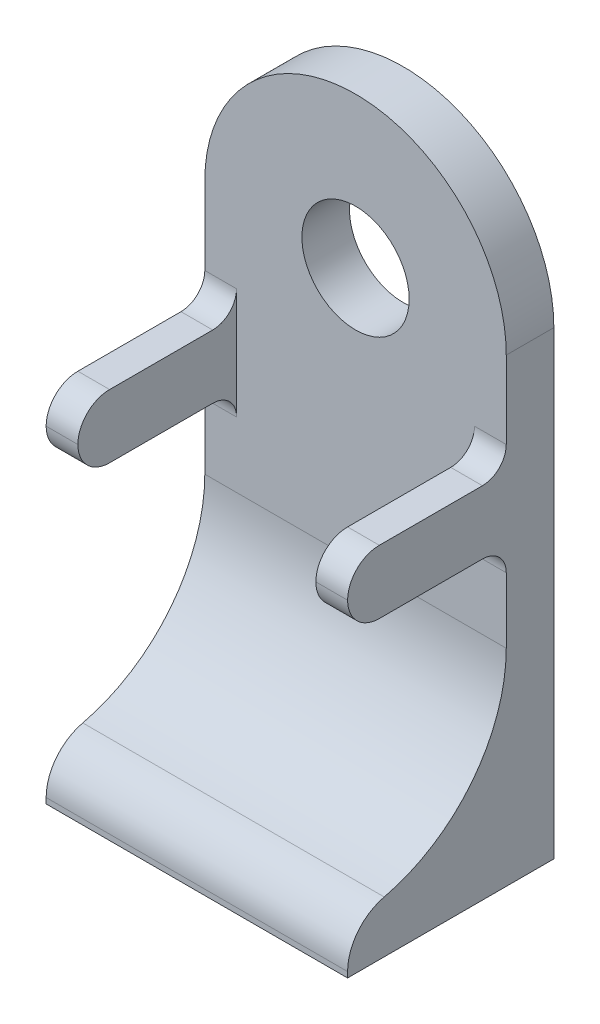
ISO-10303-21;
HEADER;
FILE_DESCRIPTION(('STEP AP214'),'2;1');
FILE_NAME('part.step','',(''),(''),'','','');
FILE_SCHEMA(('AUTOMOTIVE_DESIGN { 1 0 10303 214 1 1 1 1 }'));
ENDSEC;
DATA;
#1=APPLICATION_CONTEXT('core data for automotive mechanical design processes');
#2=APPLICATION_PROTOCOL_DEFINITION('international standard','automotive_design',2000,#1);
#3=PRODUCT_CONTEXT('',#1,'mechanical');
#4=PRODUCT('Part','Part','',(#3));
#5=PRODUCT_RELATED_PRODUCT_CATEGORY('part','',(#4));
#6=PRODUCT_DEFINITION_FORMATION('','',#4);
#7=PRODUCT_DEFINITION_CONTEXT('part definition',#1,'design');
#8=PRODUCT_DEFINITION('design','',#6,#7);
#9=PRODUCT_DEFINITION_SHAPE('','',#8);
#10=(LENGTH_UNIT() NAMED_UNIT(*) SI_UNIT(.MILLI.,.METRE.));
#11=(NAMED_UNIT(*) PLANE_ANGLE_UNIT() SI_UNIT($,.RADIAN.));
#12=(NAMED_UNIT(*) SI_UNIT($,.STERADIAN.) SOLID_ANGLE_UNIT());
#13=UNCERTAINTY_MEASURE_WITH_UNIT(LENGTH_MEASURE(1.E-05),#10,'distance_accuracy_value','');
#14=(GEOMETRIC_REPRESENTATION_CONTEXT(3) GLOBAL_UNCERTAINTY_ASSIGNED_CONTEXT((#13)) GLOBAL_UNIT_ASSIGNED_CONTEXT((#10,
#11,#12)) REPRESENTATION_CONTEXT('',''));
#15=CARTESIAN_POINT('',(0.,0.,0.));
#16=DIRECTION('',(0.,0.,1.));
#17=DIRECTION('',(1.,0.,0.));
#18=AXIS2_PLACEMENT_3D('',#15,#16,#17);
#19=CARTESIAN_POINT('',(0.,0.,3.));
#20=DIRECTION('',(0.,0.,-1.));
#21=DIRECTION('',(-1.,0.,0.));
#22=AXIS2_PLACEMENT_3D('',#19,#20,#21);
#23=PLANE('',#22);
#24=CARTESIAN_POINT('',(0.,0.,3.));
#25=DIRECTION('',(0.,0.,1.));
#26=DIRECTION('',(1.,0.,0.));
#27=AXIS2_PLACEMENT_3D('',#24,#25,#26);
#28=CIRCLE('',#27,3.38);
#29=CARTESIAN_POINT('',(3.38,0.,3.));
#30=VERTEX_POINT('',#29);
#31=EDGE_CURVE('E209',#30,#30,#28,.T.);
#32=ORIENTED_EDGE('',*,*,#31,.F.);
#33=EDGE_LOOP('',(#32));
#34=FACE_BOUND('',#33,.T.);
#35=DIRECTION('',(0.,-1.,0.));
#36=VECTOR('',#35,1.);
#37=CARTESIAN_POINT('',(-9.5,0.,3.));
#38=LINE('',#37,#36);
#39=CARTESIAN_POINT('',(-9.5,0.,3.));
#40=VERTEX_POINT('',#39);
#41=CARTESIAN_POINT('',(-9.5,-4.88,3.));
#42=VERTEX_POINT('',#41);
#43=EDGE_CURVE('E220',#40,#42,#38,.T.);
#44=ORIENTED_EDGE('',*,*,#43,.T.);
#45=DIRECTION('',(-1.,0.,0.));
#46=VECTOR('',#45,1.);
#47=CARTESIAN_POINT('',(-7.5,-4.88,3.));
#48=LINE('',#47,#46);
#49=CARTESIAN_POINT('',(-7.5,-4.88,3.));
#50=VERTEX_POINT('',#49);
#51=EDGE_CURVE('E255',#42,#50,#48,.F.);
#52=ORIENTED_EDGE('',*,*,#51,.T.);
#53=DIRECTION('',(0.,1.,0.));
#54=VECTOR('',#53,1.);
#55=CARTESIAN_POINT('',(-7.5,-6.38,3.));
#56=LINE('',#55,#54);
#57=CARTESIAN_POINT('',(-7.5,-11.88,3.));
#58=VERTEX_POINT('',#57);
#59=EDGE_CURVE('E347',#58,#50,#56,.T.);
#60=ORIENTED_EDGE('',*,*,#59,.F.);
#61=DIRECTION('',(1.,0.,0.));
#62=VECTOR('',#61,1.);
#63=CARTESIAN_POINT('',(-9.5,-11.88,3.));
#64=LINE('',#63,#62);
#65=CARTESIAN_POINT('',(-9.5,-11.88,3.));
#66=VERTEX_POINT('',#65);
#67=EDGE_CURVE('E248',#58,#66,#64,.F.);
#68=ORIENTED_EDGE('',*,*,#67,.T.);
#69=CARTESIAN_POINT('',(-9.5,-16.,3.));
#70=VERTEX_POINT('',#69);
#71=EDGE_CURVE('E218',#66,#70,#38,.T.);
#72=ORIENTED_EDGE('',*,*,#71,.T.);
#73=DIRECTION('',(1.,0.,0.));
#74=VECTOR('',#73,1.);
#75=CARTESIAN_POINT('',(0.,-16.,3.));
#76=LINE('',#75,#74);
#77=CARTESIAN_POINT('',(9.5,-16.,3.));
#78=VERTEX_POINT('',#77);
#79=EDGE_CURVE('E238',#70,#78,#76,.T.);
#80=ORIENTED_EDGE('',*,*,#79,.T.);
#81=DIRECTION('',(0.,1.,0.));
#82=VECTOR('',#81,1.);
#83=CARTESIAN_POINT('',(9.5,-29.,3.));
#84=LINE('',#83,#82);
#85=CARTESIAN_POINT('',(9.5,-11.88,3.));
#86=VERTEX_POINT('',#85);
#87=EDGE_CURVE('E224',#78,#86,#84,.T.);
#88=ORIENTED_EDGE('',*,*,#87,.T.);
#89=DIRECTION('',(1.,0.,0.));
#90=VECTOR('',#89,1.);
#91=CARTESIAN_POINT('',(7.5,-11.88,3.));
#92=LINE('',#91,#90);
#93=CARTESIAN_POINT('',(7.5,-11.88,3.));
#94=VERTEX_POINT('',#93);
#95=EDGE_CURVE('E250',#86,#94,#92,.F.);
#96=ORIENTED_EDGE('',*,*,#95,.T.);
#97=DIRECTION('',(0.,-1.,0.));
#98=VECTOR('',#97,1.);
#99=CARTESIAN_POINT('',(7.5,-6.38,3.));
#100=LINE('',#99,#98);
#101=CARTESIAN_POINT('',(7.5,-4.88,3.));
#102=VERTEX_POINT('',#101);
#103=EDGE_CURVE('E318',#102,#94,#100,.T.);
#104=ORIENTED_EDGE('',*,*,#103,.F.);
#105=DIRECTION('',(-1.,0.,0.));
#106=VECTOR('',#105,1.);
#107=CARTESIAN_POINT('',(9.5,-4.88,3.));
#108=LINE('',#107,#106);
#109=CARTESIAN_POINT('',(9.5,-4.88000000000001,3.));
#110=VERTEX_POINT('',#109);
#111=EDGE_CURVE('E253',#102,#110,#108,.F.);
#112=ORIENTED_EDGE('',*,*,#111,.T.);
#113=CARTESIAN_POINT('',(9.5,0.,3.));
#114=VERTEX_POINT('',#113);
#115=EDGE_CURVE('E223',#110,#114,#84,.T.);
#116=ORIENTED_EDGE('',*,*,#115,.T.);
#117=CARTESIAN_POINT('',(0.,0.,3.));
#118=DIRECTION('',(0.,0.,1.));
#119=DIRECTION('',(-1.,0.,0.));
#120=AXIS2_PLACEMENT_3D('',#117,#118,#119);
#121=CIRCLE('',#120,9.5);
#122=EDGE_CURVE('E215',#114,#40,#121,.T.);
#123=ORIENTED_EDGE('',*,*,#122,.T.);
#124=EDGE_LOOP('',(#44,#52,#60,#68,#72,#80,#88,#96,#104,#112,#116,#123));
#125=FACE_BOUND('',#124,.T.);
#126=ADVANCED_FACE('F38',(#34,#125),#23,.F.);
#127=CARTESIAN_POINT('',(0.,-16.,13.));
#128=DIRECTION('',(-1.,0.,0.));
#129=DIRECTION('',(0.,0.,1.));
#130=AXIS2_PLACEMENT_3D('',#127,#128,#129);
#131=CYLINDRICAL_SURFACE('',#130,10.);
#132=CARTESIAN_POINT('',(-9.5,-16.,13.));
#133=DIRECTION('',(1.,0.,0.));
#134=DIRECTION('',(0.,1.,0.));
#135=AXIS2_PLACEMENT_3D('',#132,#133,#134);
#136=CIRCLE('',#135,10.);
#137=CARTESIAN_POINT('',(-9.5,-25.7300851082104,10.6923076923077));
#138=VERTEX_POINT('',#137);
#139=EDGE_CURVE('E241',#70,#138,#136,.F.);
#140=ORIENTED_EDGE('',*,*,#139,.T.);
#141=DIRECTION('',(-1.,0.,0.));
#142=VECTOR('',#141,1.);
#143=CARTESIAN_POINT('',(0.,-25.7300851082104,10.6923076923077));
#144=LINE('',#143,#142);
#145=CARTESIAN_POINT('',(9.5,-25.7300851082104,10.6923076923077));
#146=VERTEX_POINT('',#145);
#147=EDGE_CURVE('E46',#138,#146,#144,.F.);
#148=ORIENTED_EDGE('',*,*,#147,.T.);
#149=CARTESIAN_POINT('',(9.5,-16.,13.));
#150=DIRECTION('',(-1.,0.,0.));
#151=DIRECTION('',(0.,-1.,0.));
#152=AXIS2_PLACEMENT_3D('',#149,#150,#151);
#153=CIRCLE('',#152,10.);
#154=EDGE_CURVE('E243',#146,#78,#153,.F.);
#155=ORIENTED_EDGE('',*,*,#154,.T.);
#156=ORIENTED_EDGE('',*,*,#79,.F.);
#157=EDGE_LOOP('',(#140,#148,#155,#156));
#158=FACE_BOUND('',#157,.T.);
#159=ADVANCED_FACE('F427',(#158),#131,.F.);
#160=CARTESIAN_POINT('',(0.,0.,0.));
#161=DIRECTION('',(0.,0.,-1.));
#162=DIRECTION('',(-1.,0.,0.));
#163=AXIS2_PLACEMENT_3D('',#160,#161,#162);
#164=PLANE('',#163);
#165=CARTESIAN_POINT('',(0.,0.,0.));
#166=DIRECTION('',(0.,0.,1.));
#167=DIRECTION('',(-1.,0.,0.));
#168=AXIS2_PLACEMENT_3D('',#165,#166,#167);
#169=CIRCLE('',#168,9.5);
#170=CARTESIAN_POINT('',(9.5,0.,0.));
#171=VERTEX_POINT('',#170);
#172=CARTESIAN_POINT('',(-9.5,0.,0.));
#173=VERTEX_POINT('',#172);
#174=EDGE_CURVE('E212',#171,#173,#169,.T.);
#175=ORIENTED_EDGE('',*,*,#174,.F.);
#176=DIRECTION('',(0.,1.,0.));
#177=VECTOR('',#176,1.);
#178=CARTESIAN_POINT('',(9.5,-29.,0.));
#179=LINE('',#178,#177);
#180=CARTESIAN_POINT('',(9.5,-29.,0.));
#181=VERTEX_POINT('',#180);
#182=EDGE_CURVE('E219',#181,#171,#179,.T.);
#183=ORIENTED_EDGE('',*,*,#182,.F.);
#184=DIRECTION('',(1.,0.,0.));
#185=VECTOR('',#184,1.);
#186=CARTESIAN_POINT('',(-9.5,-29.,0.));
#187=LINE('',#186,#185);
#188=CARTESIAN_POINT('',(-9.5,-29.,0.));
#189=VERTEX_POINT('',#188);
#190=EDGE_CURVE('E231',#189,#181,#187,.T.);
#191=ORIENTED_EDGE('',*,*,#190,.F.);
#192=DIRECTION('',(0.,-1.,0.));
#193=VECTOR('',#192,1.);
#194=CARTESIAN_POINT('',(-9.5,0.,0.));
#195=LINE('',#194,#193);
#196=EDGE_CURVE('E195',#173,#189,#195,.T.);
#197=ORIENTED_EDGE('',*,*,#196,.F.);
#198=EDGE_LOOP('',(#175,#183,#191,#197));
#199=FACE_BOUND('',#198,.T.);
#200=CARTESIAN_POINT('',(0.,0.,0.));
#201=DIRECTION('',(0.,0.,1.));
#202=DIRECTION('',(1.,0.,0.));
#203=AXIS2_PLACEMENT_3D('',#200,#201,#202);
#204=CIRCLE('',#203,3.38);
#205=CARTESIAN_POINT('',(3.38,0.,0.));
#206=VERTEX_POINT('',#205);
#207=EDGE_CURVE('E205',#206,#206,#204,.T.);
#208=ORIENTED_EDGE('',*,*,#207,.T.);
#209=EDGE_LOOP('',(#208));
#210=FACE_BOUND('',#209,.T.);
#211=ADVANCED_FACE('F433',(#199,#210),#164,.T.);
#212=CARTESIAN_POINT('',(0.,0.,3.));
#213=DIRECTION('',(0.,0.,-1.));
#214=DIRECTION('',(-1.,0.,0.));
#215=AXIS2_PLACEMENT_3D('',#212,#213,#214);
#216=CYLINDRICAL_SURFACE('',#215,9.5);
#217=ORIENTED_EDGE('',*,*,#174,.T.);
#218=DIRECTION('',(0.,0.,-1.));
#219=VECTOR('',#218,1.);
#220=CARTESIAN_POINT('',(-9.5,0.,3.));
#221=LINE('',#220,#219);
#222=EDGE_CURVE('E198',#40,#173,#221,.T.);
#223=ORIENTED_EDGE('',*,*,#222,.F.);
#224=ORIENTED_EDGE('',*,*,#122,.F.);
#225=DIRECTION('',(0.,0.,-1.));
#226=VECTOR('',#225,1.);
#227=CARTESIAN_POINT('',(9.5,0.,3.));
#228=LINE('',#227,#226);
#229=EDGE_CURVE('E227',#114,#171,#228,.T.);
#230=ORIENTED_EDGE('',*,*,#229,.T.);
#231=EDGE_LOOP('',(#217,#223,#224,#230));
#232=FACE_BOUND('',#231,.T.);
#233=ADVANCED_FACE('F400',(#232),#216,.T.);
#234=CARTESIAN_POINT('',(-9.5,0.,3.));
#235=DIRECTION('',(1.,0.,0.));
#236=DIRECTION('',(0.,1.,0.));
#237=AXIS2_PLACEMENT_3D('',#234,#235,#236);
#238=PLANE('',#237);
#239=DIRECTION('',(0.,-1.,0.));
#240=VECTOR('',#239,1.);
#241=CARTESIAN_POINT('',(-9.5,-29.,13.));
#242=LINE('',#241,#240);
#243=CARTESIAN_POINT('',(-9.5,-28.6491106406735,13.));
#244=VERTEX_POINT('',#243);
#245=CARTESIAN_POINT('',(-9.5,-29.,13.));
#246=VERTEX_POINT('',#245);
#247=EDGE_CURVE('E180',#244,#246,#242,.T.);
#248=ORIENTED_EDGE('',*,*,#247,.F.);
#249=CARTESIAN_POINT('',(-9.5,-28.6491106406735,10.));
#250=DIRECTION('',(1.,0.,0.));
#251=DIRECTION('',(0.,1.,0.));
#252=AXIS2_PLACEMENT_3D('',#249,#250,#251);
#253=CIRCLE('',#252,3.);
#254=EDGE_CURVE('E60',#244,#138,#253,.F.);
#255=ORIENTED_EDGE('',*,*,#254,.T.);
#256=ORIENTED_EDGE('',*,*,#139,.F.);
#257=ORIENTED_EDGE('',*,*,#71,.F.);
#258=CARTESIAN_POINT('',(-9.5,-11.88,4.5));
#259=DIRECTION('',(1.,0.,0.));
#260=DIRECTION('',(0.,1.,0.));
#261=AXIS2_PLACEMENT_3D('',#258,#259,#260);
#262=CIRCLE('',#261,1.5);
#263=CARTESIAN_POINT('',(-9.5,-10.38,4.5));
#264=VERTEX_POINT('',#263);
#265=EDGE_CURVE('E286',#66,#264,#262,.T.);
#266=ORIENTED_EDGE('',*,*,#265,.T.);
#267=DIRECTION('',(0.,0.,-1.));
#268=VECTOR('',#267,1.);
#269=CARTESIAN_POINT('',(-9.5,-10.38,13.));
#270=LINE('',#269,#268);
#271=CARTESIAN_POINT('',(-9.5,-10.38,11.));
#272=VERTEX_POINT('',#271);
#273=EDGE_CURVE('E340',#272,#264,#270,.T.);
#274=ORIENTED_EDGE('',*,*,#273,.F.);
#275=CARTESIAN_POINT('',(-9.5,-8.38,11.));
#276=DIRECTION('',(1.,0.,0.));
#277=DIRECTION('',(0.,1.,0.));
#278=AXIS2_PLACEMENT_3D('',#275,#276,#277);
#279=CIRCLE('',#278,2.);
#280=CARTESIAN_POINT('',(-9.5,-8.38,13.));
#281=VERTEX_POINT('',#280);
#282=EDGE_CURVE('E311',#272,#281,#279,.F.);
#283=ORIENTED_EDGE('',*,*,#282,.T.);
#284=CARTESIAN_POINT('',(-9.5,-8.38,11.));
#285=DIRECTION('',(1.,0.,0.));
#286=DIRECTION('',(0.,1.,0.));
#287=AXIS2_PLACEMENT_3D('',#284,#285,#286);
#288=CIRCLE('',#287,2.);
#289=CARTESIAN_POINT('',(-9.5,-6.38,11.));
#290=VERTEX_POINT('',#289);
#291=EDGE_CURVE('E309',#281,#290,#288,.F.);
#292=ORIENTED_EDGE('',*,*,#291,.T.);
#293=DIRECTION('',(0.,0.,-1.));
#294=VECTOR('',#293,1.);
#295=CARTESIAN_POINT('',(-9.5,-6.38,13.));
#296=LINE('',#295,#294);
#297=CARTESIAN_POINT('',(-9.5,-6.38,4.5));
#298=VERTEX_POINT('',#297);
#299=EDGE_CURVE('E189',#290,#298,#296,.T.);
#300=ORIENTED_EDGE('',*,*,#299,.T.);
#301=CARTESIAN_POINT('',(-9.5,-4.88,4.5));
#302=DIRECTION('',(1.,0.,0.));
#303=DIRECTION('',(0.,1.,0.));
#304=AXIS2_PLACEMENT_3D('',#301,#302,#303);
#305=CIRCLE('',#304,1.5);
#306=EDGE_CURVE('E267',#298,#42,#305,.T.);
#307=ORIENTED_EDGE('',*,*,#306,.T.);
#308=ORIENTED_EDGE('',*,*,#43,.F.);
#309=ORIENTED_EDGE('',*,*,#222,.T.);
#310=ORIENTED_EDGE('',*,*,#196,.T.);
#311=DIRECTION('',(0.,0.,-1.));
#312=VECTOR('',#311,1.);
#313=CARTESIAN_POINT('',(-9.5,-29.,3.));
#314=LINE('',#313,#312);
#315=EDGE_CURVE('E192',#246,#189,#314,.T.);
#316=ORIENTED_EDGE('',*,*,#315,.F.);
#317=EDGE_LOOP('',(#248,#255,#256,#257,#266,#274,#283,#292,#300,#307,#308,#309,#310,#316));
#318=FACE_BOUND('',#317,.T.);
#319=ADVANCED_FACE('F193',(#318),#238,.F.);
#320=CARTESIAN_POINT('',(-9.5,-29.,3.));
#321=DIRECTION('',(0.,1.,0.));
#322=DIRECTION('',(0.,0.,1.));
#323=AXIS2_PLACEMENT_3D('',#320,#321,#322);
#324=PLANE('',#323);
#325=ORIENTED_EDGE('',*,*,#190,.T.);
#326=DIRECTION('',(0.,0.,-1.));
#327=VECTOR('',#326,1.);
#328=CARTESIAN_POINT('',(9.5,-29.,3.));
#329=LINE('',#328,#327);
#330=CARTESIAN_POINT('',(9.5,-29.,13.));
#331=VERTEX_POINT('',#330);
#332=EDGE_CURVE('E199',#331,#181,#329,.T.);
#333=ORIENTED_EDGE('',*,*,#332,.F.);
#334=DIRECTION('',(1.,0.,0.));
#335=VECTOR('',#334,1.);
#336=CARTESIAN_POINT('',(-9.5,-29.,13.));
#337=LINE('',#336,#335);
#338=EDGE_CURVE('E185',#246,#331,#337,.T.);
#339=ORIENTED_EDGE('',*,*,#338,.F.);
#340=ORIENTED_EDGE('',*,*,#315,.T.);
#341=EDGE_LOOP('',(#325,#333,#339,#340));
#342=FACE_BOUND('',#341,.T.);
#343=ADVANCED_FACE('F201',(#342),#324,.F.);
#344=CARTESIAN_POINT('',(9.5,-29.,3.));
#345=DIRECTION('',(-1.,0.,0.));
#346=DIRECTION('',(0.,-1.,0.));
#347=AXIS2_PLACEMENT_3D('',#344,#345,#346);
#348=PLANE('',#347);
#349=ORIENTED_EDGE('',*,*,#154,.F.);
#350=CARTESIAN_POINT('',(9.5,-28.6491106406735,10.));
#351=DIRECTION('',(-1.,0.,0.));
#352=DIRECTION('',(0.,-1.,0.));
#353=AXIS2_PLACEMENT_3D('',#350,#351,#352);
#354=CIRCLE('',#353,3.);
#355=CARTESIAN_POINT('',(9.5,-28.6491106406735,13.));
#356=VERTEX_POINT('',#355);
#357=EDGE_CURVE('E11',#146,#356,#354,.F.);
#358=ORIENTED_EDGE('',*,*,#357,.T.);
#359=DIRECTION('',(0.,1.,0.));
#360=VECTOR('',#359,1.);
#361=CARTESIAN_POINT('',(9.5,-29.,13.));
#362=LINE('',#361,#360);
#363=EDGE_CURVE('E203',#331,#356,#362,.T.);
#364=ORIENTED_EDGE('',*,*,#363,.F.);
#365=ORIENTED_EDGE('',*,*,#332,.T.);
#366=ORIENTED_EDGE('',*,*,#182,.T.);
#367=ORIENTED_EDGE('',*,*,#229,.F.);
#368=ORIENTED_EDGE('',*,*,#115,.F.);
#369=CARTESIAN_POINT('',(9.5,-4.88,4.5));
#370=DIRECTION('',(-1.,0.,0.));
#371=DIRECTION('',(0.,-1.,0.));
#372=AXIS2_PLACEMENT_3D('',#369,#370,#371);
#373=CIRCLE('',#372,1.5);
#374=CARTESIAN_POINT('',(9.5,-6.38,4.5));
#375=VERTEX_POINT('',#374);
#376=EDGE_CURVE('E275',#110,#375,#373,.T.);
#377=ORIENTED_EDGE('',*,*,#376,.T.);
#378=DIRECTION('',(0.,0.,-1.));
#379=VECTOR('',#378,1.);
#380=CARTESIAN_POINT('',(9.5,-6.38,13.));
#381=LINE('',#380,#379);
#382=CARTESIAN_POINT('',(9.5,-6.38,11.));
#383=VERTEX_POINT('',#382);
#384=EDGE_CURVE('E349',#383,#375,#381,.T.);
#385=ORIENTED_EDGE('',*,*,#384,.F.);
#386=CARTESIAN_POINT('',(9.5,-8.38,11.));
#387=DIRECTION('',(-1.,0.,0.));
#388=DIRECTION('',(0.,-1.,0.));
#389=AXIS2_PLACEMENT_3D('',#386,#387,#388);
#390=CIRCLE('',#389,2.);
#391=CARTESIAN_POINT('',(9.5,-8.38,13.));
#392=VERTEX_POINT('',#391);
#393=EDGE_CURVE('E289',#383,#392,#390,.F.);
#394=ORIENTED_EDGE('',*,*,#393,.T.);
#395=CARTESIAN_POINT('',(9.5,-8.38,11.));
#396=DIRECTION('',(-1.,0.,0.));
#397=DIRECTION('',(0.,-1.,0.));
#398=AXIS2_PLACEMENT_3D('',#395,#396,#397);
#399=CIRCLE('',#398,2.);
#400=CARTESIAN_POINT('',(9.5,-10.38,11.));
#401=VERTEX_POINT('',#400);
#402=EDGE_CURVE('E291',#392,#401,#399,.F.);
#403=ORIENTED_EDGE('',*,*,#402,.T.);
#404=DIRECTION('',(0.,0.,-1.));
#405=VECTOR('',#404,1.);
#406=CARTESIAN_POINT('',(9.5,-10.38,13.));
#407=LINE('',#406,#405);
#408=CARTESIAN_POINT('',(9.5,-10.38,4.5));
#409=VERTEX_POINT('',#408);
#410=EDGE_CURVE('E355',#401,#409,#407,.T.);
#411=ORIENTED_EDGE('',*,*,#410,.T.);
#412=CARTESIAN_POINT('',(9.5,-11.88,4.5));
#413=DIRECTION('',(-1.,0.,0.));
#414=DIRECTION('',(0.,-1.,0.));
#415=AXIS2_PLACEMENT_3D('',#412,#413,#414);
#416=CIRCLE('',#415,1.5);
#417=EDGE_CURVE('E278',#409,#86,#416,.T.);
#418=ORIENTED_EDGE('',*,*,#417,.T.);
#419=ORIENTED_EDGE('',*,*,#87,.F.);
#420=EDGE_LOOP('',(#349,#358,#364,#365,#366,#367,#368,#377,#385,#394,#403,#411,#418,#419));
#421=FACE_BOUND('',#420,.T.);
#422=ADVANCED_FACE('F385',(#421),#348,.F.);
#423=CARTESIAN_POINT('',(0.,0.,3.));
#424=DIRECTION('',(0.,0.,-1.));
#425=DIRECTION('',(-1.,0.,0.));
#426=AXIS2_PLACEMENT_3D('',#423,#424,#425);
#427=CYLINDRICAL_SURFACE('',#426,3.38);
#428=ORIENTED_EDGE('',*,*,#31,.T.);
#429=EDGE_LOOP('',(#428));
#430=FACE_BOUND('',#429,.T.);
#431=ORIENTED_EDGE('',*,*,#207,.F.);
#432=EDGE_LOOP('',(#431));
#433=FACE_BOUND('',#432,.T.);
#434=ADVANCED_FACE('F438',(#430,#433),#427,.F.);
#435=CARTESIAN_POINT('',(0.,0.,13.));
#436=DIRECTION('',(0.,0.,-1.));
#437=DIRECTION('',(-1.,0.,0.));
#438=AXIS2_PLACEMENT_3D('',#435,#436,#437);
#439=PLANE('',#438);
#440=ORIENTED_EDGE('',*,*,#363,.T.);
#441=DIRECTION('',(-1.,0.,0.));
#442=VECTOR('',#441,1.);
#443=CARTESIAN_POINT('',(0.,-28.6491106406735,13.));
#444=LINE('',#443,#442);
#445=EDGE_CURVE('E188',#356,#244,#444,.T.);
#446=ORIENTED_EDGE('',*,*,#445,.T.);
#447=ORIENTED_EDGE('',*,*,#247,.T.);
#448=ORIENTED_EDGE('',*,*,#338,.T.);
#449=EDGE_LOOP('',(#440,#446,#447,#448));
#450=FACE_BOUND('',#449,.T.);
#451=ADVANCED_FACE('F183',(#450),#439,.F.);
#452=CARTESIAN_POINT('',(-7.5,-6.38,13.));
#453=DIRECTION('',(0.,-1.,0.));
#454=DIRECTION('',(0.,0.,-1.));
#455=AXIS2_PLACEMENT_3D('',#452,#453,#454);
#456=PLANE('',#455);
#457=ORIENTED_EDGE('',*,*,#299,.F.);
#458=DIRECTION('',(-1.,0.,0.));
#459=VECTOR('',#458,1.);
#460=CARTESIAN_POINT('',(-7.5,-6.38,11.));
#461=LINE('',#460,#459);
#462=CARTESIAN_POINT('',(-7.5,-6.38,11.));
#463=VERTEX_POINT('',#462);
#464=EDGE_CURVE('E313',#290,#463,#461,.F.);
#465=ORIENTED_EDGE('',*,*,#464,.T.);
#466=DIRECTION('',(0.,0.,-1.));
#467=VECTOR('',#466,1.);
#468=CARTESIAN_POINT('',(-7.5,-6.38,13.));
#469=LINE('',#468,#467);
#470=CARTESIAN_POINT('',(-7.5,-6.38,4.5));
#471=VERTEX_POINT('',#470);
#472=EDGE_CURVE('E345',#463,#471,#469,.T.);
#473=ORIENTED_EDGE('',*,*,#472,.T.);
#474=DIRECTION('',(-1.,0.,0.));
#475=VECTOR('',#474,1.);
#476=CARTESIAN_POINT('',(-9.5,-6.38,4.5));
#477=LINE('',#476,#475);
#478=EDGE_CURVE('E245',#471,#298,#477,.T.);
#479=ORIENTED_EDGE('',*,*,#478,.T.);
#480=EDGE_LOOP('',(#457,#465,#473,#479));
#481=FACE_BOUND('',#480,.T.);
#482=ADVANCED_FACE('F337',(#481),#456,.F.);
#483=CARTESIAN_POINT('',(-7.5,-10.38,13.));
#484=DIRECTION('',(0.,1.,0.));
#485=DIRECTION('',(0.,0.,1.));
#486=AXIS2_PLACEMENT_3D('',#483,#484,#485);
#487=PLANE('',#486);
#488=DIRECTION('',(0.,0.,-1.));
#489=VECTOR('',#488,1.);
#490=CARTESIAN_POINT('',(-7.5,-10.38,13.));
#491=LINE('',#490,#489);
#492=CARTESIAN_POINT('',(-7.5,-10.38,11.));
#493=VERTEX_POINT('',#492);
#494=CARTESIAN_POINT('',(-7.5,-10.38,4.5));
#495=VERTEX_POINT('',#494);
#496=EDGE_CURVE('E341',#493,#495,#491,.T.);
#497=ORIENTED_EDGE('',*,*,#496,.F.);
#498=DIRECTION('',(1.,0.,0.));
#499=VECTOR('',#498,1.);
#500=CARTESIAN_POINT('',(-7.5,-10.38,11.));
#501=LINE('',#500,#499);
#502=EDGE_CURVE('E306',#493,#272,#501,.F.);
#503=ORIENTED_EDGE('',*,*,#502,.T.);
#504=ORIENTED_EDGE('',*,*,#273,.T.);
#505=DIRECTION('',(1.,0.,0.));
#506=VECTOR('',#505,1.);
#507=CARTESIAN_POINT('',(-7.5,-10.38,4.5));
#508=LINE('',#507,#506);
#509=EDGE_CURVE('E264',#264,#495,#508,.T.);
#510=ORIENTED_EDGE('',*,*,#509,.T.);
#511=EDGE_LOOP('',(#497,#503,#504,#510));
#512=FACE_BOUND('',#511,.T.);
#513=ADVANCED_FACE('F417',(#512),#487,.F.);
#514=CARTESIAN_POINT('',(-7.5,-6.38,13.));
#515=DIRECTION('',(-1.,0.,0.));
#516=DIRECTION('',(0.,0.,1.));
#517=AXIS2_PLACEMENT_3D('',#514,#515,#516);
#518=PLANE('',#517);
#519=CARTESIAN_POINT('',(-7.5,-8.38,11.));
#520=DIRECTION('',(-1.,0.,0.));
#521=DIRECTION('',(0.,0.,1.));
#522=AXIS2_PLACEMENT_3D('',#519,#520,#521);
#523=CIRCLE('',#522,2.);
#524=CARTESIAN_POINT('',(-7.5,-8.38,13.));
#525=VERTEX_POINT('',#524);
#526=EDGE_CURVE('E302',#463,#525,#523,.F.);
#527=ORIENTED_EDGE('',*,*,#526,.T.);
#528=CARTESIAN_POINT('',(-7.5,-8.38,11.));
#529=DIRECTION('',(-1.,0.,0.));
#530=DIRECTION('',(0.,0.,1.));
#531=AXIS2_PLACEMENT_3D('',#528,#529,#530);
#532=CIRCLE('',#531,2.);
#533=EDGE_CURVE('E304',#525,#493,#532,.F.);
#534=ORIENTED_EDGE('',*,*,#533,.T.);
#535=ORIENTED_EDGE('',*,*,#496,.T.);
#536=CARTESIAN_POINT('',(-7.5,-11.88,4.5));
#537=DIRECTION('',(-1.,0.,0.));
#538=DIRECTION('',(0.,0.,1.));
#539=AXIS2_PLACEMENT_3D('',#536,#537,#538);
#540=CIRCLE('',#539,1.5);
#541=EDGE_CURVE('E283',#495,#58,#540,.T.);
#542=ORIENTED_EDGE('',*,*,#541,.T.);
#543=ORIENTED_EDGE('',*,*,#59,.T.);
#544=CARTESIAN_POINT('',(-7.5,-4.88,4.5));
#545=DIRECTION('',(-1.,0.,0.));
#546=DIRECTION('',(0.,0.,1.));
#547=AXIS2_PLACEMENT_3D('',#544,#545,#546);
#548=CIRCLE('',#547,1.5);
#549=EDGE_CURVE('E269',#50,#471,#548,.T.);
#550=ORIENTED_EDGE('',*,*,#549,.T.);
#551=ORIENTED_EDGE('',*,*,#472,.F.);
#552=EDGE_LOOP('',(#527,#534,#535,#542,#543,#550,#551));
#553=FACE_BOUND('',#552,.T.);
#554=ADVANCED_FACE('F406',(#553),#518,.F.);
#555=CARTESIAN_POINT('',(7.5,-6.38,13.));
#556=DIRECTION('',(0.,-1.,0.));
#557=DIRECTION('',(0.,0.,-1.));
#558=AXIS2_PLACEMENT_3D('',#555,#556,#557);
#559=PLANE('',#558);
#560=DIRECTION('',(0.,0.,-1.));
#561=VECTOR('',#560,1.);
#562=CARTESIAN_POINT('',(7.5,-6.38,13.));
#563=LINE('',#562,#561);
#564=CARTESIAN_POINT('',(7.5,-6.38,11.));
#565=VERTEX_POINT('',#564);
#566=CARTESIAN_POINT('',(7.5,-6.38,4.5));
#567=VERTEX_POINT('',#566);
#568=EDGE_CURVE('E351',#565,#567,#563,.T.);
#569=ORIENTED_EDGE('',*,*,#568,.F.);
#570=DIRECTION('',(-1.,0.,0.));
#571=VECTOR('',#570,1.);
#572=CARTESIAN_POINT('',(7.5,-6.38,11.));
#573=LINE('',#572,#571);
#574=EDGE_CURVE('E300',#565,#383,#573,.F.);
#575=ORIENTED_EDGE('',*,*,#574,.T.);
#576=ORIENTED_EDGE('',*,*,#384,.T.);
#577=DIRECTION('',(-1.,0.,0.));
#578=VECTOR('',#577,1.);
#579=CARTESIAN_POINT('',(7.5,-6.38,4.5));
#580=LINE('',#579,#578);
#581=EDGE_CURVE('E258',#375,#567,#580,.T.);
#582=ORIENTED_EDGE('',*,*,#581,.T.);
#583=EDGE_LOOP('',(#569,#575,#576,#582));
#584=FACE_BOUND('',#583,.T.);
#585=ADVANCED_FACE('F391',(#584),#559,.F.);
#586=CARTESIAN_POINT('',(7.5,-6.38,13.));
#587=DIRECTION('',(1.,0.,0.));
#588=DIRECTION('',(0.,0.,-1.));
#589=AXIS2_PLACEMENT_3D('',#586,#587,#588);
#590=PLANE('',#589);
#591=DIRECTION('',(0.,0.,-1.));
#592=VECTOR('',#591,1.);
#593=CARTESIAN_POINT('',(7.5,-10.38,13.));
#594=LINE('',#593,#592);
#595=CARTESIAN_POINT('',(7.5,-10.38,11.));
#596=VERTEX_POINT('',#595);
#597=CARTESIAN_POINT('',(7.5,-10.38,4.5));
#598=VERTEX_POINT('',#597);
#599=EDGE_CURVE('E353',#596,#598,#594,.T.);
#600=ORIENTED_EDGE('',*,*,#599,.F.);
#601=CARTESIAN_POINT('',(7.5,-8.38,11.));
#602=DIRECTION('',(1.,0.,0.));
#603=DIRECTION('',(0.,0.,-1.));
#604=AXIS2_PLACEMENT_3D('',#601,#602,#603);
#605=CIRCLE('',#604,2.);
#606=CARTESIAN_POINT('',(7.5,-8.38,13.));
#607=VERTEX_POINT('',#606);
#608=EDGE_CURVE('E298',#596,#607,#605,.F.);
#609=ORIENTED_EDGE('',*,*,#608,.T.);
#610=CARTESIAN_POINT('',(7.5,-8.38,11.));
#611=DIRECTION('',(1.,0.,0.));
#612=DIRECTION('',(0.,0.,-1.));
#613=AXIS2_PLACEMENT_3D('',#610,#611,#612);
#614=CIRCLE('',#613,2.);
#615=EDGE_CURVE('E296',#607,#565,#614,.F.);
#616=ORIENTED_EDGE('',*,*,#615,.T.);
#617=ORIENTED_EDGE('',*,*,#568,.T.);
#618=CARTESIAN_POINT('',(7.5,-4.88,4.5));
#619=DIRECTION('',(1.,0.,0.));
#620=DIRECTION('',(0.,0.,-1.));
#621=AXIS2_PLACEMENT_3D('',#618,#619,#620);
#622=CIRCLE('',#621,1.5);
#623=EDGE_CURVE('E272',#567,#102,#622,.T.);
#624=ORIENTED_EDGE('',*,*,#623,.T.);
#625=ORIENTED_EDGE('',*,*,#103,.T.);
#626=CARTESIAN_POINT('',(7.5,-11.88,4.5));
#627=DIRECTION('',(1.,0.,0.));
#628=DIRECTION('',(0.,0.,-1.));
#629=AXIS2_PLACEMENT_3D('',#626,#627,#628);
#630=CIRCLE('',#629,1.5);
#631=EDGE_CURVE('E280',#94,#598,#630,.T.);
#632=ORIENTED_EDGE('',*,*,#631,.T.);
#633=EDGE_LOOP('',(#600,#609,#616,#617,#624,#625,#632));
#634=FACE_BOUND('',#633,.T.);
#635=ADVANCED_FACE('F359',(#634),#590,.F.);
#636=CARTESIAN_POINT('',(7.5,-10.38,13.));
#637=DIRECTION('',(0.,1.,0.));
#638=DIRECTION('',(0.,0.,1.));
#639=AXIS2_PLACEMENT_3D('',#636,#637,#638);
#640=PLANE('',#639);
#641=ORIENTED_EDGE('',*,*,#410,.F.);
#642=DIRECTION('',(1.,0.,0.));
#643=VECTOR('',#642,1.);
#644=CARTESIAN_POINT('',(7.5,-10.38,11.));
#645=LINE('',#644,#643);
#646=EDGE_CURVE('E293',#401,#596,#645,.F.);
#647=ORIENTED_EDGE('',*,*,#646,.T.);
#648=ORIENTED_EDGE('',*,*,#599,.T.);
#649=DIRECTION('',(1.,0.,0.));
#650=VECTOR('',#649,1.);
#651=CARTESIAN_POINT('',(9.5,-10.38,4.5));
#652=LINE('',#651,#650);
#653=EDGE_CURVE('E261',#598,#409,#652,.T.);
#654=ORIENTED_EDGE('',*,*,#653,.T.);
#655=EDGE_LOOP('',(#641,#647,#648,#654));
#656=FACE_BOUND('',#655,.T.);
#657=ADVANCED_FACE('F372',(#656),#640,.F.);
#658=CARTESIAN_POINT('',(-7.5,-4.88,4.5));
#659=DIRECTION('',(1.,0.,0.));
#660=DIRECTION('',(0.,0.,-1.));
#661=AXIS2_PLACEMENT_3D('',#658,#659,#660);
#662=CYLINDRICAL_SURFACE('',#661,1.5);
#663=ORIENTED_EDGE('',*,*,#549,.F.);
#664=ORIENTED_EDGE('',*,*,#51,.F.);
#665=ORIENTED_EDGE('',*,*,#306,.F.);
#666=ORIENTED_EDGE('',*,*,#478,.F.);
#667=EDGE_LOOP('',(#663,#664,#665,#666));
#668=FACE_BOUND('',#667,.T.);
#669=ADVANCED_FACE('F404',(#668),#662,.F.);
#670=CARTESIAN_POINT('',(7.5,-4.88,4.5));
#671=DIRECTION('',(1.,0.,0.));
#672=DIRECTION('',(0.,0.,-1.));
#673=AXIS2_PLACEMENT_3D('',#670,#671,#672);
#674=CYLINDRICAL_SURFACE('',#673,1.5);
#675=ORIENTED_EDGE('',*,*,#376,.F.);
#676=ORIENTED_EDGE('',*,*,#111,.F.);
#677=ORIENTED_EDGE('',*,*,#623,.F.);
#678=ORIENTED_EDGE('',*,*,#581,.F.);
#679=EDGE_LOOP('',(#675,#676,#677,#678));
#680=FACE_BOUND('',#679,.T.);
#681=ADVANCED_FACE('F393',(#680),#674,.F.);
#682=CARTESIAN_POINT('',(7.5,-11.88,4.5));
#683=DIRECTION('',(-1.,0.,0.));
#684=DIRECTION('',(0.,0.,1.));
#685=AXIS2_PLACEMENT_3D('',#682,#683,#684);
#686=CYLINDRICAL_SURFACE('',#685,1.5);
#687=ORIENTED_EDGE('',*,*,#631,.F.);
#688=ORIENTED_EDGE('',*,*,#95,.F.);
#689=ORIENTED_EDGE('',*,*,#417,.F.);
#690=ORIENTED_EDGE('',*,*,#653,.F.);
#691=EDGE_LOOP('',(#687,#688,#689,#690));
#692=FACE_BOUND('',#691,.T.);
#693=ADVANCED_FACE('F369',(#692),#686,.F.);
#694=CARTESIAN_POINT('',(-7.5,-11.88,4.5));
#695=DIRECTION('',(-1.,0.,0.));
#696=DIRECTION('',(0.,0.,1.));
#697=AXIS2_PLACEMENT_3D('',#694,#695,#696);
#698=CYLINDRICAL_SURFACE('',#697,1.5);
#699=ORIENTED_EDGE('',*,*,#265,.F.);
#700=ORIENTED_EDGE('',*,*,#67,.F.);
#701=ORIENTED_EDGE('',*,*,#541,.F.);
#702=ORIENTED_EDGE('',*,*,#509,.F.);
#703=EDGE_LOOP('',(#699,#700,#701,#702));
#704=FACE_BOUND('',#703,.T.);
#705=ADVANCED_FACE('F414',(#704),#698,.F.);
#706=CARTESIAN_POINT('',(0.,-8.38,11.));
#707=DIRECTION('',(-1.,0.,0.));
#708=DIRECTION('',(0.,0.,1.));
#709=AXIS2_PLACEMENT_3D('',#706,#707,#708);
#710=CYLINDRICAL_SURFACE('',#709,2.);
#711=ORIENTED_EDGE('',*,*,#574,.F.);
#712=ORIENTED_EDGE('',*,*,#615,.F.);
#713=DIRECTION('',(-1.,0.,0.));
#714=VECTOR('',#713,1.);
#715=CARTESIAN_POINT('',(0.,-8.38,13.));
#716=LINE('',#715,#714);
#717=EDGE_CURVE('E315',#392,#607,#716,.T.);
#718=ORIENTED_EDGE('',*,*,#717,.F.);
#719=ORIENTED_EDGE('',*,*,#393,.F.);
#720=EDGE_LOOP('',(#711,#712,#718,#719));
#721=FACE_BOUND('',#720,.T.);
#722=ADVANCED_FACE('F380',(#721),#710,.T.);
#723=CARTESIAN_POINT('',(0.,-8.38,11.));
#724=DIRECTION('',(1.,0.,0.));
#725=DIRECTION('',(0.,0.,-1.));
#726=AXIS2_PLACEMENT_3D('',#723,#724,#725);
#727=CYLINDRICAL_SURFACE('',#726,2.);
#728=ORIENTED_EDGE('',*,*,#608,.F.);
#729=ORIENTED_EDGE('',*,*,#646,.F.);
#730=ORIENTED_EDGE('',*,*,#402,.F.);
#731=ORIENTED_EDGE('',*,*,#717,.T.);
#732=EDGE_LOOP('',(#728,#729,#730,#731));
#733=FACE_BOUND('',#732,.T.);
#734=ADVANCED_FACE('F383',(#733),#727,.T.);
#735=CARTESIAN_POINT('',(0.,-8.38,11.));
#736=DIRECTION('',(-1.,0.,0.));
#737=DIRECTION('',(0.,0.,1.));
#738=AXIS2_PLACEMENT_3D('',#735,#736,#737);
#739=CYLINDRICAL_SURFACE('',#738,2.);
#740=ORIENTED_EDGE('',*,*,#464,.F.);
#741=ORIENTED_EDGE('',*,*,#291,.F.);
#742=DIRECTION('',(-1.,0.,0.));
#743=VECTOR('',#742,1.);
#744=CARTESIAN_POINT('',(0.,-8.38,13.));
#745=LINE('',#744,#743);
#746=EDGE_CURVE('E319',#525,#281,#745,.T.);
#747=ORIENTED_EDGE('',*,*,#746,.F.);
#748=ORIENTED_EDGE('',*,*,#526,.F.);
#749=EDGE_LOOP('',(#740,#741,#747,#748));
#750=FACE_BOUND('',#749,.T.);
#751=ADVANCED_FACE('F332',(#750),#739,.T.);
#752=CARTESIAN_POINT('',(0.,-8.38,11.));
#753=DIRECTION('',(1.,0.,0.));
#754=DIRECTION('',(0.,0.,-1.));
#755=AXIS2_PLACEMENT_3D('',#752,#753,#754);
#756=CYLINDRICAL_SURFACE('',#755,2.);
#757=ORIENTED_EDGE('',*,*,#282,.F.);
#758=ORIENTED_EDGE('',*,*,#502,.F.);
#759=ORIENTED_EDGE('',*,*,#533,.F.);
#760=ORIENTED_EDGE('',*,*,#746,.T.);
#761=EDGE_LOOP('',(#757,#758,#759,#760));
#762=FACE_BOUND('',#761,.T.);
#763=ADVANCED_FACE('F326',(#762),#756,.T.);
#764=CARTESIAN_POINT('',(0.,-28.6491106406735,10.));
#765=DIRECTION('',(-1.,0.,0.));
#766=DIRECTION('',(0.,0.,1.));
#767=AXIS2_PLACEMENT_3D('',#764,#765,#766);
#768=CYLINDRICAL_SURFACE('',#767,3.);
#769=ORIENTED_EDGE('',*,*,#357,.F.);
#770=ORIENTED_EDGE('',*,*,#147,.F.);
#771=ORIENTED_EDGE('',*,*,#254,.F.);
#772=ORIENTED_EDGE('',*,*,#445,.F.);
#773=EDGE_LOOP('',(#769,#770,#771,#772));
#774=FACE_BOUND('',#773,.T.);
#775=ADVANCED_FACE('F40',(#774),#768,.T.);
#776=CLOSED_SHELL('',(#126,#159,#211,#233,#319,#343,#422,#434,#451,#482,#513,#554,#585,#635,
#657,#669,#681,#693,#705,#722,#734,#751,#763,#775));
#777=MANIFOLD_SOLID_BREP('B2',#776);
#778=ADVANCED_BREP_SHAPE_REPRESENTATION('',(#18,#777),#14);
#779=SHAPE_DEFINITION_REPRESENTATION(#9,#778);
ENDSEC;
END-ISO-10303-21;
